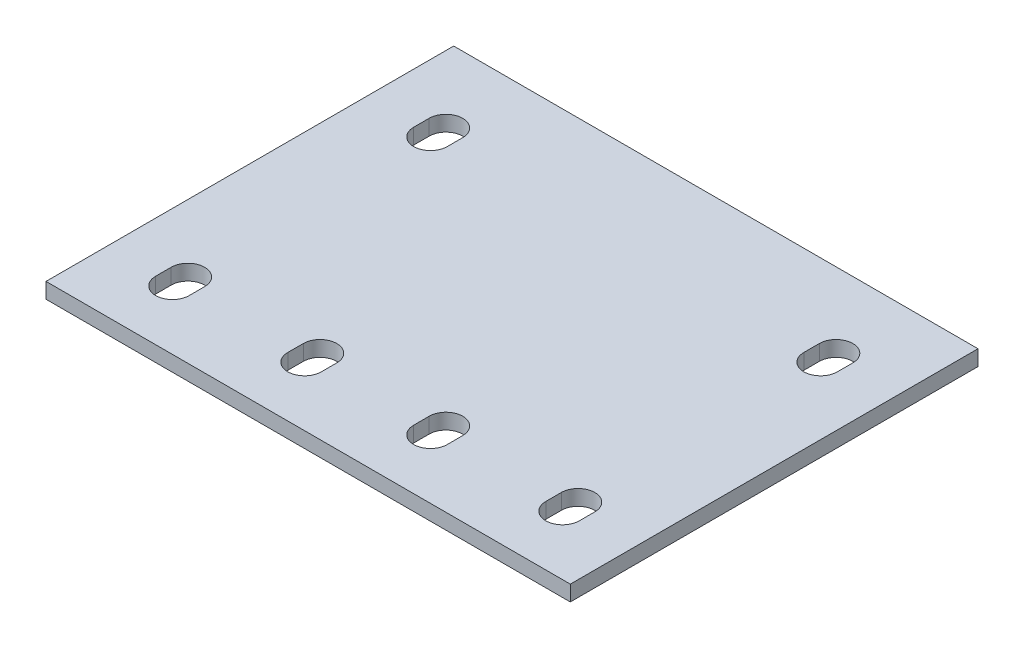
ISO-10303-21;
HEADER;
FILE_DESCRIPTION(('STEP AP214'),'2;1');
FILE_NAME('part.step','',(''),(''),'','','');
FILE_SCHEMA(('AUTOMOTIVE_DESIGN { 1 0 10303 214 1 1 1 1 }'));
ENDSEC;
DATA;
#1=APPLICATION_CONTEXT('core data for automotive mechanical design processes');
#2=APPLICATION_PROTOCOL_DEFINITION('international standard','automotive_design',2000,#1);
#3=PRODUCT_CONTEXT('',#1,'mechanical');
#4=PRODUCT('Part','Part','',(#3));
#5=PRODUCT_RELATED_PRODUCT_CATEGORY('part','',(#4));
#6=PRODUCT_DEFINITION_FORMATION('','',#4);
#7=PRODUCT_DEFINITION_CONTEXT('part definition',#1,'design');
#8=PRODUCT_DEFINITION('design','',#6,#7);
#9=PRODUCT_DEFINITION_SHAPE('','',#8);
#10=(LENGTH_UNIT() NAMED_UNIT(*) SI_UNIT(.MILLI.,.METRE.));
#11=(NAMED_UNIT(*) PLANE_ANGLE_UNIT() SI_UNIT($,.RADIAN.));
#12=(NAMED_UNIT(*) SI_UNIT($,.STERADIAN.) SOLID_ANGLE_UNIT());
#13=UNCERTAINTY_MEASURE_WITH_UNIT(LENGTH_MEASURE(1.E-05),#10,'distance_accuracy_value','');
#14=(GEOMETRIC_REPRESENTATION_CONTEXT(3) GLOBAL_UNCERTAINTY_ASSIGNED_CONTEXT((#13)) GLOBAL_UNIT_ASSIGNED_CONTEXT((#10,
#11,#12)) REPRESENTATION_CONTEXT('',''));
#15=CARTESIAN_POINT('',(0.,0.,0.));
#16=DIRECTION('',(0.,0.,1.));
#17=DIRECTION('',(1.,0.,0.));
#18=AXIS2_PLACEMENT_3D('',#15,#16,#17);
#19=CARTESIAN_POINT('',(0.,3.,0.));
#20=DIRECTION('',(0.,-0.999999999999999,0.));
#21=DIRECTION('',(0.,0.,-0.999999999999999));
#22=AXIS2_PLACEMENT_3D('',#19,#20,#21);
#23=PLANE('',#22);
#24=CARTESIAN_POINT('',(82.2274092895389,3.00000000000003,-51.5));
#25=DIRECTION('',(0.,0.999999999999999,0.));
#26=DIRECTION('',(0.,0.,0.999999999999999));
#27=AXIS2_PLACEMENT_3D('',#24,#25,#26);
#28=CIRCLE('',#27,3.25);
#29=CARTESIAN_POINT('',(85.4774092895388,3.00000000000003,-51.5000000000001));
#30=VERTEX_POINT('',#29);
#31=CARTESIAN_POINT('',(78.9774092895388,3.00000000000003,-51.5));
#32=VERTEX_POINT('',#31);
#33=EDGE_CURVE('E281',#30,#32,#28,.T.);
#34=ORIENTED_EDGE('',*,*,#33,.F.);
#35=DIRECTION('',(0.,0.,-0.999999999999999));
#36=VECTOR('',#35,1.);
#37=CARTESIAN_POINT('',(85.4774092895388,3.00000000000003,-51.5000000000001));
#38=LINE('',#37,#36);
#39=CARTESIAN_POINT('',(85.4774092895388,3.00000000000003,-48.5000000000001));
#40=VERTEX_POINT('',#39);
#41=EDGE_CURVE('E292',#40,#30,#38,.T.);
#42=ORIENTED_EDGE('',*,*,#41,.F.);
#43=CARTESIAN_POINT('',(82.2274092895389,3.00000000000003,-48.5000000000001));
#44=DIRECTION('',(0.,0.999999999999999,0.));
#45=DIRECTION('',(0.,0.,0.999999999999999));
#46=AXIS2_PLACEMENT_3D('',#43,#44,#45);
#47=CIRCLE('',#46,3.25);
#48=CARTESIAN_POINT('',(78.9774092895389,3.00000000000003,-48.5000000000001));
#49=VERTEX_POINT('',#48);
#50=EDGE_CURVE('E288',#49,#40,#47,.T.);
#51=ORIENTED_EDGE('',*,*,#50,.F.);
#52=DIRECTION('',(0.,0.,0.999999999999999));
#53=VECTOR('',#52,1.);
#54=CARTESIAN_POINT('',(78.9774092895388,3.00000000000003,-51.5));
#55=LINE('',#54,#53);
#56=EDGE_CURVE('E284',#32,#49,#55,.T.);
#57=ORIENTED_EDGE('',*,*,#56,.F.);
#58=EDGE_LOOP('',(#34,#42,#51,#57));
#59=FACE_BOUND('',#58,.T.);
#60=CARTESIAN_POINT('',(82.2274092895388,3.,-1.50000000000009));
#61=DIRECTION('',(0.,0.999999999999999,0.));
#62=DIRECTION('',(0.,0.,-0.999999999999999));
#63=AXIS2_PLACEMENT_3D('',#60,#61,#62);
#64=CIRCLE('',#63,3.25);
#65=CARTESIAN_POINT('',(85.4774092895389,3.,-1.50000000000019));
#66=VERTEX_POINT('',#65);
#67=CARTESIAN_POINT('',(78.9774092895388,2.99999999999995,-1.50000000000019));
#68=VERTEX_POINT('',#67);
#69=EDGE_CURVE('E367',#66,#68,#64,.T.);
#70=ORIENTED_EDGE('',*,*,#69,.F.);
#71=DIRECTION('',(0.,0.,-0.999999999999999));
#72=VECTOR('',#71,1.);
#73=CARTESIAN_POINT('',(85.4774092895389,3.,-1.50000000000019));
#74=LINE('',#73,#72);
#75=CARTESIAN_POINT('',(85.477409289539,2.99999999999998,1.4999999999999));
#76=VERTEX_POINT('',#75);
#77=EDGE_CURVE('E378',#76,#66,#74,.T.);
#78=ORIENTED_EDGE('',*,*,#77,.F.);
#79=CARTESIAN_POINT('',(82.2274092895388,3.00000000000006,1.4999999999999));
#80=DIRECTION('',(0.,0.999999999999999,0.));
#81=DIRECTION('',(0.,0.,-0.999999999999999));
#82=AXIS2_PLACEMENT_3D('',#79,#80,#81);
#83=CIRCLE('',#82,3.25);
#84=CARTESIAN_POINT('',(78.9774092895389,3.,1.49999999999991));
#85=VERTEX_POINT('',#84);
#86=EDGE_CURVE('E374',#85,#76,#83,.T.);
#87=ORIENTED_EDGE('',*,*,#86,.F.);
#88=DIRECTION('',(0.,0.,0.999999999999999));
#89=VECTOR('',#88,1.);
#90=CARTESIAN_POINT('',(78.9774092895388,2.99999999999995,-1.50000000000019));
#91=LINE('',#90,#89);
#92=EDGE_CURVE('E370',#68,#85,#91,.T.);
#93=ORIENTED_EDGE('',*,*,#92,.F.);
#94=EDGE_LOOP('',(#70,#78,#87,#93));
#95=FACE_BOUND('',#94,.T.);
#96=CARTESIAN_POINT('',(6.62740928953888,2.99999999999998,-1.50000000000005));
#97=DIRECTION('',(0.,0.999999999999999,0.));
#98=DIRECTION('',(0.,0.,0.999999999999999));
#99=AXIS2_PLACEMENT_3D('',#96,#97,#98);
#100=CIRCLE('',#99,3.24999999999999);
#101=CARTESIAN_POINT('',(9.87740928953888,3.,-1.49999999999999));
#102=VERTEX_POINT('',#101);
#103=CARTESIAN_POINT('',(3.37740928953889,3.,-1.50000000000004));
#104=VERTEX_POINT('',#103);
#105=EDGE_CURVE('E453',#102,#104,#100,.T.);
#106=ORIENTED_EDGE('',*,*,#105,.F.);
#107=DIRECTION('',(0.,0.,-0.999999999999999));
#108=VECTOR('',#107,1.);
#109=CARTESIAN_POINT('',(9.87740928953888,3.,-1.49999999999999));
#110=LINE('',#109,#108);
#111=CARTESIAN_POINT('',(9.87740928953891,3.,1.49999999999994));
#112=VERTEX_POINT('',#111);
#113=EDGE_CURVE('E464',#112,#102,#110,.T.);
#114=ORIENTED_EDGE('',*,*,#113,.F.);
#115=CARTESIAN_POINT('',(6.62740928953881,3.,1.49999999999994));
#116=DIRECTION('',(0.,0.999999999999999,0.));
#117=DIRECTION('',(0.,0.,0.999999999999999));
#118=AXIS2_PLACEMENT_3D('',#115,#116,#117);
#119=CIRCLE('',#118,3.24999999999999);
#120=CARTESIAN_POINT('',(3.37740928953884,3.,1.49999999999992));
#121=VERTEX_POINT('',#120);
#122=EDGE_CURVE('E460',#121,#112,#119,.T.);
#123=ORIENTED_EDGE('',*,*,#122,.F.);
#124=DIRECTION('',(0.,0.,0.999999999999999));
#125=VECTOR('',#124,1.);
#126=CARTESIAN_POINT('',(3.37740928953889,3.,-1.50000000000004));
#127=LINE('',#126,#125);
#128=EDGE_CURVE('E456',#104,#121,#127,.T.);
#129=ORIENTED_EDGE('',*,*,#128,.F.);
#130=EDGE_LOOP('',(#106,#114,#123,#129));
#131=FACE_BOUND('',#130,.T.);
#132=DIRECTION('',(0.,0.,0.999999999999999));
#133=VECTOR('',#132,1.);
#134=CARTESIAN_POINT('',(-6.3725907104611,3.,12.9999999999999));
#135=LINE('',#134,#133);
#136=CARTESIAN_POINT('',(-6.37259071046108,3.00000000000003,-66.));
#137=VERTEX_POINT('',#136);
#138=CARTESIAN_POINT('',(-6.3725907104611,3.,12.9999999999999));
#139=VERTEX_POINT('',#138);
#140=EDGE_CURVE('E496',#137,#139,#135,.T.);
#141=ORIENTED_EDGE('',*,*,#140,.T.);
#142=DIRECTION('',(0.999999999999999,0.,0.));
#143=VECTOR('',#142,1.);
#144=CARTESIAN_POINT('',(95.2274092895388,3.,12.9999999999999));
#145=LINE('',#144,#143);
#146=CARTESIAN_POINT('',(95.2274092895388,3.,12.9999999999999));
#147=VERTEX_POINT('',#146);
#148=EDGE_CURVE('E500',#139,#147,#145,.T.);
#149=ORIENTED_EDGE('',*,*,#148,.T.);
#150=DIRECTION('',(0.,0.,-0.999999999999999));
#151=VECTOR('',#150,1.);
#152=CARTESIAN_POINT('',(95.2274092895389,3.00000000000006,-66.));
#153=LINE('',#152,#151);
#154=CARTESIAN_POINT('',(95.2274092895389,3.00000000000006,-66.));
#155=VERTEX_POINT('',#154);
#156=EDGE_CURVE('E504',#147,#155,#153,.T.);
#157=ORIENTED_EDGE('',*,*,#156,.T.);
#158=DIRECTION('',(-0.999999999999999,0.,0.));
#159=VECTOR('',#158,1.);
#160=CARTESIAN_POINT('',(-6.37259071046108,3.00000000000003,-66.));
#161=LINE('',#160,#159);
#162=EDGE_CURVE('E507',#155,#137,#161,.T.);
#163=ORIENTED_EDGE('',*,*,#162,.T.);
#164=EDGE_LOOP('',(#141,#149,#157,#163));
#165=FACE_BOUND('',#164,.T.);
#166=CARTESIAN_POINT('',(6.62740928953888,2.99999999999998,-51.5));
#167=DIRECTION('',(0.,0.999999999999999,0.));
#168=DIRECTION('',(0.,0.,0.999999999999999));
#169=AXIS2_PLACEMENT_3D('',#166,#167,#168);
#170=CIRCLE('',#169,3.25);
#171=CARTESIAN_POINT('',(9.87740928953897,3.,-51.5));
#172=VERTEX_POINT('',#171);
#173=CARTESIAN_POINT('',(3.3774092895389,3.,-51.5));
#174=VERTEX_POINT('',#173);
#175=EDGE_CURVE('E410',#172,#174,#170,.T.);
#176=ORIENTED_EDGE('',*,*,#175,.F.);
#177=DIRECTION('',(0.,0.,-0.999999999999999));
#178=VECTOR('',#177,1.);
#179=CARTESIAN_POINT('',(9.87740928953897,3.,-51.5));
#180=LINE('',#179,#178);
#181=CARTESIAN_POINT('',(9.87740928953891,2.99999999999998,-48.5));
#182=VERTEX_POINT('',#181);
#183=EDGE_CURVE('E421',#182,#172,#180,.T.);
#184=ORIENTED_EDGE('',*,*,#183,.F.);
#185=CARTESIAN_POINT('',(6.62740928953889,3.00000000000006,-48.5));
#186=DIRECTION('',(0.,0.999999999999999,0.));
#187=DIRECTION('',(0.,0.,0.999999999999999));
#188=AXIS2_PLACEMENT_3D('',#185,#186,#187);
#189=CIRCLE('',#188,3.25);
#190=CARTESIAN_POINT('',(3.37740928953893,2.99999999999998,-48.5));
#191=VERTEX_POINT('',#190);
#192=EDGE_CURVE('E417',#191,#182,#189,.T.);
#193=ORIENTED_EDGE('',*,*,#192,.F.);
#194=DIRECTION('',(0.,0.,0.999999999999999));
#195=VECTOR('',#194,1.);
#196=CARTESIAN_POINT('',(3.3774092895389,3.,-51.5));
#197=LINE('',#196,#195);
#198=EDGE_CURVE('E413',#174,#191,#197,.T.);
#199=ORIENTED_EDGE('',*,*,#198,.F.);
#200=EDGE_LOOP('',(#176,#184,#193,#199));
#201=FACE_BOUND('',#200,.T.);
#202=CARTESIAN_POINT('',(56.6274092895388,2.99999999999998,-1.50000000000013));
#203=DIRECTION('',(0.,0.999999999999999,0.));
#204=DIRECTION('',(0.,0.,0.999999999999999));
#205=AXIS2_PLACEMENT_3D('',#202,#203,#204);
#206=CIRCLE('',#205,3.25000000000001);
#207=CARTESIAN_POINT('',(59.8774092895389,3.00000000000003,-1.5000000000001));
#208=VERTEX_POINT('',#207);
#209=CARTESIAN_POINT('',(53.3774092895388,3.,-1.50000000000006));
#210=VERTEX_POINT('',#209);
#211=EDGE_CURVE('E324',#208,#210,#206,.T.);
#212=ORIENTED_EDGE('',*,*,#211,.F.);
#213=DIRECTION('',(0.,0.,-0.999999999999999));
#214=VECTOR('',#213,1.);
#215=CARTESIAN_POINT('',(59.8774092895389,3.00000000000003,-1.5000000000001));
#216=LINE('',#215,#214);
#217=CARTESIAN_POINT('',(59.8774092895388,2.99999999999995,1.49999999999983));
#218=VERTEX_POINT('',#217);
#219=EDGE_CURVE('E335',#218,#208,#216,.T.);
#220=ORIENTED_EDGE('',*,*,#219,.F.);
#221=CARTESIAN_POINT('',(56.6274092895389,3.00000000000003,1.49999999999988));
#222=DIRECTION('',(0.,0.999999999999999,0.));
#223=DIRECTION('',(0.,0.,0.999999999999999));
#224=AXIS2_PLACEMENT_3D('',#221,#222,#223);
#225=CIRCLE('',#224,3.25000000000001);
#226=CARTESIAN_POINT('',(53.3774092895388,3.00000000000003,1.49999999999994));
#227=VERTEX_POINT('',#226);
#228=EDGE_CURVE('E331',#227,#218,#225,.T.);
#229=ORIENTED_EDGE('',*,*,#228,.F.);
#230=DIRECTION('',(0.,0.,0.999999999999999));
#231=VECTOR('',#230,1.);
#232=CARTESIAN_POINT('',(53.3774092895388,3.,-1.50000000000006));
#233=LINE('',#232,#231);
#234=EDGE_CURVE('E327',#210,#227,#233,.T.);
#235=ORIENTED_EDGE('',*,*,#234,.F.);
#236=EDGE_LOOP('',(#212,#220,#229,#235));
#237=FACE_BOUND('',#236,.T.);
#238=CARTESIAN_POINT('',(32.2274092895389,3.,-1.50000000000006));
#239=DIRECTION('',(0.,0.999999999999999,0.));
#240=DIRECTION('',(0.,0.,-0.999999999999999));
#241=AXIS2_PLACEMENT_3D('',#238,#239,#240);
#242=CIRCLE('',#241,3.25);
#243=CARTESIAN_POINT('',(35.4774092895388,2.99999999999998,-1.50000000000006));
#244=VERTEX_POINT('',#243);
#245=CARTESIAN_POINT('',(28.9774092895388,3.,-1.5000000000001));
#246=VERTEX_POINT('',#245);
#247=EDGE_CURVE('E232',#244,#246,#242,.T.);
#248=ORIENTED_EDGE('',*,*,#247,.F.);
#249=DIRECTION('',(0.,0.,-0.999999999999999));
#250=VECTOR('',#249,1.);
#251=CARTESIAN_POINT('',(35.4774092895388,2.99999999999998,-1.50000000000006));
#252=LINE('',#251,#250);
#253=CARTESIAN_POINT('',(35.4774092895389,3.,1.49999999999995));
#254=VERTEX_POINT('',#253);
#255=EDGE_CURVE('E259',#254,#244,#252,.T.);
#256=ORIENTED_EDGE('',*,*,#255,.F.);
#257=CARTESIAN_POINT('',(32.2274092895388,3.00000000000003,1.4999999999999));
#258=DIRECTION('',(0.,0.999999999999999,0.));
#259=DIRECTION('',(0.,0.,-0.999999999999999));
#260=AXIS2_PLACEMENT_3D('',#257,#258,#259);
#261=CIRCLE('',#260,3.25);
#262=CARTESIAN_POINT('',(28.9774092895388,2.99999999999995,1.49999999999997));
#263=VERTEX_POINT('',#262);
#264=EDGE_CURVE('E254',#263,#254,#261,.T.);
#265=ORIENTED_EDGE('',*,*,#264,.F.);
#266=DIRECTION('',(0.,0.,0.999999999999999));
#267=VECTOR('',#266,1.);
#268=CARTESIAN_POINT('',(28.9774092895388,3.,-1.5000000000001));
#269=LINE('',#268,#267);
#270=EDGE_CURVE('E241',#246,#263,#269,.T.);
#271=ORIENTED_EDGE('',*,*,#270,.F.);
#272=EDGE_LOOP('',(#248,#256,#265,#271));
#273=FACE_BOUND('',#272,.T.);
#274=ADVANCED_FACE('F46',(#59,#95,#131,#165,#201,#237,#273),#23,.F.);
#275=CARTESIAN_POINT('',(0.,0.,0.));
#276=DIRECTION('',(0.,-0.999999999999999,0.));
#277=DIRECTION('',(0.,0.,-0.999999999999999));
#278=AXIS2_PLACEMENT_3D('',#275,#276,#277);
#279=PLANE('',#278);
#280=DIRECTION('',(0.,0.,0.999999999999999));
#281=VECTOR('',#280,1.);
#282=CARTESIAN_POINT('',(-6.37259071046116,0.,12.9999999999999));
#283=LINE('',#282,#281);
#284=CARTESIAN_POINT('',(-6.37259071046108,0.,-65.9999999999999));
#285=VERTEX_POINT('',#284);
#286=CARTESIAN_POINT('',(-6.37259071046116,0.,12.9999999999999));
#287=VERTEX_POINT('',#286);
#288=EDGE_CURVE('E495',#285,#287,#283,.T.);
#289=ORIENTED_EDGE('',*,*,#288,.F.);
#290=DIRECTION('',(-0.999999999999999,0.,0.));
#291=VECTOR('',#290,1.);
#292=CARTESIAN_POINT('',(-6.37259071046108,0.,-65.9999999999999));
#293=LINE('',#292,#291);
#294=CARTESIAN_POINT('',(95.2274092895389,0.,-66.));
#295=VERTEX_POINT('',#294);
#296=EDGE_CURVE('E501',#295,#285,#293,.T.);
#297=ORIENTED_EDGE('',*,*,#296,.F.);
#298=DIRECTION('',(0.,0.,-0.999999999999999));
#299=VECTOR('',#298,1.);
#300=CARTESIAN_POINT('',(95.2274092895389,0.,-66.));
#301=LINE('',#300,#299);
#302=CARTESIAN_POINT('',(95.2274092895388,0.,12.9999999999998));
#303=VERTEX_POINT('',#302);
#304=EDGE_CURVE('E517',#303,#295,#301,.T.);
#305=ORIENTED_EDGE('',*,*,#304,.F.);
#306=DIRECTION('',(0.999999999999999,0.,0.));
#307=VECTOR('',#306,1.);
#308=CARTESIAN_POINT('',(95.2274092895388,0.,12.9999999999998));
#309=LINE('',#308,#307);
#310=EDGE_CURVE('E514',#287,#303,#309,.T.);
#311=ORIENTED_EDGE('',*,*,#310,.F.);
#312=EDGE_LOOP('',(#289,#297,#305,#311));
#313=FACE_BOUND('',#312,.T.);
#314=DIRECTION('',(0.,0.,-0.999999999999999));
#315=VECTOR('',#314,1.);
#316=CARTESIAN_POINT('',(9.87740928953883,0.,-1.50000000000001));
#317=LINE('',#316,#315);
#318=CARTESIAN_POINT('',(9.8774092895389,0.,1.49999999999997));
#319=VERTEX_POINT('',#318);
#320=CARTESIAN_POINT('',(9.87740928953883,0.,-1.50000000000001));
#321=VERTEX_POINT('',#320);
#322=EDGE_CURVE('E457',#319,#321,#317,.T.);
#323=ORIENTED_EDGE('',*,*,#322,.T.);
#324=CARTESIAN_POINT('',(6.62740928953887,0.,-1.50000000000012));
#325=DIRECTION('',(0.,0.999999999999999,0.));
#326=DIRECTION('',(0.,0.,0.999999999999999));
#327=AXIS2_PLACEMENT_3D('',#324,#325,#326);
#328=CIRCLE('',#327,3.24999999999999);
#329=CARTESIAN_POINT('',(3.37740928953888,0.,-1.50000000000003));
#330=VERTEX_POINT('',#329);
#331=EDGE_CURVE('E452',#321,#330,#328,.T.);
#332=ORIENTED_EDGE('',*,*,#331,.T.);
#333=DIRECTION('',(0.,0.,0.999999999999999));
#334=VECTOR('',#333,1.);
#335=CARTESIAN_POINT('',(3.37740928953888,0.,-1.50000000000003));
#336=LINE('',#335,#334);
#337=CARTESIAN_POINT('',(3.37740928953889,0.,1.49999999999995));
#338=VERTEX_POINT('',#337);
#339=EDGE_CURVE('E471',#330,#338,#336,.T.);
#340=ORIENTED_EDGE('',*,*,#339,.T.);
#341=CARTESIAN_POINT('',(6.62740928953888,0.,1.49999999999997));
#342=DIRECTION('',(0.,0.999999999999999,0.));
#343=DIRECTION('',(0.,0.,0.999999999999999));
#344=AXIS2_PLACEMENT_3D('',#341,#342,#343);
#345=CIRCLE('',#344,3.24999999999999);
#346=EDGE_CURVE('E475',#338,#319,#345,.T.);
#347=ORIENTED_EDGE('',*,*,#346,.T.);
#348=EDGE_LOOP('',(#323,#332,#340,#347));
#349=FACE_BOUND('',#348,.T.);
#350=DIRECTION('',(0.,0.,-0.999999999999999));
#351=VECTOR('',#350,1.);
#352=CARTESIAN_POINT('',(9.8774092895389,0.,-51.4999999999999));
#353=LINE('',#352,#351);
#354=CARTESIAN_POINT('',(9.8774092895389,0.,-48.4999999999999));
#355=VERTEX_POINT('',#354);
#356=CARTESIAN_POINT('',(9.8774092895389,0.,-51.4999999999999));
#357=VERTEX_POINT('',#356);
#358=EDGE_CURVE('E414',#355,#357,#353,.T.);
#359=ORIENTED_EDGE('',*,*,#358,.T.);
#360=CARTESIAN_POINT('',(6.62740928953888,0.,-51.5));
#361=DIRECTION('',(0.,0.999999999999999,0.));
#362=DIRECTION('',(0.,0.,0.999999999999999));
#363=AXIS2_PLACEMENT_3D('',#360,#361,#362);
#364=CIRCLE('',#363,3.25);
#365=CARTESIAN_POINT('',(3.3774092895389,0.,-51.5));
#366=VERTEX_POINT('',#365);
#367=EDGE_CURVE('E409',#357,#366,#364,.T.);
#368=ORIENTED_EDGE('',*,*,#367,.T.);
#369=DIRECTION('',(0.,0.,0.999999999999999));
#370=VECTOR('',#369,1.);
#371=CARTESIAN_POINT('',(3.3774092895389,0.,-51.5));
#372=LINE('',#371,#370);
#373=CARTESIAN_POINT('',(3.37740928953895,0.,-48.5));
#374=VERTEX_POINT('',#373);
#375=EDGE_CURVE('E428',#366,#374,#372,.T.);
#376=ORIENTED_EDGE('',*,*,#375,.T.);
#377=CARTESIAN_POINT('',(6.62740928953894,0.,-48.5));
#378=DIRECTION('',(0.,0.999999999999999,0.));
#379=DIRECTION('',(0.,0.,0.999999999999999));
#380=AXIS2_PLACEMENT_3D('',#377,#378,#379);
#381=CIRCLE('',#380,3.25);
#382=EDGE_CURVE('E432',#374,#355,#381,.T.);
#383=ORIENTED_EDGE('',*,*,#382,.T.);
#384=EDGE_LOOP('',(#359,#368,#376,#383));
#385=FACE_BOUND('',#384,.T.);
#386=DIRECTION('',(0.,0.,-0.999999999999999));
#387=VECTOR('',#386,1.);
#388=CARTESIAN_POINT('',(85.4774092895388,0.,-1.50000000000009));
#389=LINE('',#388,#387);
#390=CARTESIAN_POINT('',(85.4774092895389,0.,1.4999999999999));
#391=VERTEX_POINT('',#390);
#392=CARTESIAN_POINT('',(85.4774092895388,0.,-1.50000000000009));
#393=VERTEX_POINT('',#392);
#394=EDGE_CURVE('E371',#391,#393,#389,.T.);
#395=ORIENTED_EDGE('',*,*,#394,.T.);
#396=CARTESIAN_POINT('',(82.2274092895388,0.,-1.50000000000009));
#397=DIRECTION('',(0.,0.999999999999999,0.));
#398=DIRECTION('',(0.,0.,-0.999999999999999));
#399=AXIS2_PLACEMENT_3D('',#396,#397,#398);
#400=CIRCLE('',#399,3.25);
#401=CARTESIAN_POINT('',(78.9774092895389,0.,-1.50000000000015));
#402=VERTEX_POINT('',#401);
#403=EDGE_CURVE('E366',#393,#402,#400,.T.);
#404=ORIENTED_EDGE('',*,*,#403,.T.);
#405=DIRECTION('',(0.,0.,0.999999999999999));
#406=VECTOR('',#405,1.);
#407=CARTESIAN_POINT('',(78.9774092895389,0.,-1.50000000000015));
#408=LINE('',#407,#406);
#409=CARTESIAN_POINT('',(78.9774092895388,0.,1.49999999999992));
#410=VERTEX_POINT('',#409);
#411=EDGE_CURVE('E385',#402,#410,#408,.T.);
#412=ORIENTED_EDGE('',*,*,#411,.T.);
#413=CARTESIAN_POINT('',(82.2274092895388,0.,1.4999999999999));
#414=DIRECTION('',(0.,0.999999999999999,0.));
#415=DIRECTION('',(0.,0.,-0.999999999999999));
#416=AXIS2_PLACEMENT_3D('',#413,#414,#415);
#417=CIRCLE('',#416,3.25);
#418=EDGE_CURVE('E389',#410,#391,#417,.T.);
#419=ORIENTED_EDGE('',*,*,#418,.T.);
#420=EDGE_LOOP('',(#395,#404,#412,#419));
#421=FACE_BOUND('',#420,.T.);
#422=DIRECTION('',(0.,0.,-0.999999999999999));
#423=VECTOR('',#422,1.);
#424=CARTESIAN_POINT('',(59.8774092895388,0.,-1.50000000000017));
#425=LINE('',#424,#423);
#426=CARTESIAN_POINT('',(59.8774092895388,0.,1.49999999999994));
#427=VERTEX_POINT('',#426);
#428=CARTESIAN_POINT('',(59.8774092895388,0.,-1.50000000000017));
#429=VERTEX_POINT('',#428);
#430=EDGE_CURVE('E328',#427,#429,#425,.T.);
#431=ORIENTED_EDGE('',*,*,#430,.T.);
#432=CARTESIAN_POINT('',(56.6274092895388,0.,-1.50000000000013));
#433=DIRECTION('',(0.,0.999999999999999,0.));
#434=DIRECTION('',(0.,0.,0.999999999999999));
#435=AXIS2_PLACEMENT_3D('',#432,#433,#434);
#436=CIRCLE('',#435,3.25000000000001);
#437=CARTESIAN_POINT('',(53.3774092895388,0.,-1.50000000000006));
#438=VERTEX_POINT('',#437);
#439=EDGE_CURVE('E323',#429,#438,#436,.T.);
#440=ORIENTED_EDGE('',*,*,#439,.T.);
#441=DIRECTION('',(0.,0.,0.999999999999999));
#442=VECTOR('',#441,1.);
#443=CARTESIAN_POINT('',(53.3774092895388,0.,-1.50000000000006));
#444=LINE('',#443,#442);
#445=CARTESIAN_POINT('',(53.3774092895388,0.,1.49999999999994));
#446=VERTEX_POINT('',#445);
#447=EDGE_CURVE('E342',#438,#446,#444,.T.);
#448=ORIENTED_EDGE('',*,*,#447,.T.);
#449=CARTESIAN_POINT('',(56.6274092895388,0.,1.49999999999981));
#450=DIRECTION('',(0.,0.999999999999999,0.));
#451=DIRECTION('',(0.,0.,0.999999999999999));
#452=AXIS2_PLACEMENT_3D('',#449,#450,#451);
#453=CIRCLE('',#452,3.25000000000001);
#454=EDGE_CURVE('E346',#446,#427,#453,.T.);
#455=ORIENTED_EDGE('',*,*,#454,.T.);
#456=EDGE_LOOP('',(#431,#440,#448,#455));
#457=FACE_BOUND('',#456,.T.);
#458=DIRECTION('',(0.,0.,-0.999999999999999));
#459=VECTOR('',#458,1.);
#460=CARTESIAN_POINT('',(85.4774092895389,0.,-51.5));
#461=LINE('',#460,#459);
#462=CARTESIAN_POINT('',(85.4774092895389,0.,-48.5000000000001));
#463=VERTEX_POINT('',#462);
#464=CARTESIAN_POINT('',(85.4774092895389,0.,-51.5));
#465=VERTEX_POINT('',#464);
#466=EDGE_CURVE('E285',#463,#465,#461,.T.);
#467=ORIENTED_EDGE('',*,*,#466,.T.);
#468=CARTESIAN_POINT('',(82.2274092895388,0.,-51.5000000000001));
#469=DIRECTION('',(0.,0.999999999999999,0.));
#470=DIRECTION('',(0.,0.,0.999999999999999));
#471=AXIS2_PLACEMENT_3D('',#468,#469,#470);
#472=CIRCLE('',#471,3.25);
#473=CARTESIAN_POINT('',(78.9774092895388,0.,-51.5));
#474=VERTEX_POINT('',#473);
#475=EDGE_CURVE('E250',#465,#474,#472,.T.);
#476=ORIENTED_EDGE('',*,*,#475,.T.);
#477=DIRECTION('',(0.,0.,0.999999999999999));
#478=VECTOR('',#477,1.);
#479=CARTESIAN_POINT('',(78.9774092895388,0.,-51.5));
#480=LINE('',#479,#478);
#481=CARTESIAN_POINT('',(78.9774092895389,0.,-48.5));
#482=VERTEX_POINT('',#481);
#483=EDGE_CURVE('E299',#474,#482,#480,.T.);
#484=ORIENTED_EDGE('',*,*,#483,.T.);
#485=CARTESIAN_POINT('',(82.2274092895388,0.,-48.5000000000001));
#486=DIRECTION('',(0.,0.999999999999999,0.));
#487=DIRECTION('',(0.,0.,0.999999999999999));
#488=AXIS2_PLACEMENT_3D('',#485,#486,#487);
#489=CIRCLE('',#488,3.25);
#490=EDGE_CURVE('E303',#482,#463,#489,.T.);
#491=ORIENTED_EDGE('',*,*,#490,.T.);
#492=EDGE_LOOP('',(#467,#476,#484,#491));
#493=FACE_BOUND('',#492,.T.);
#494=DIRECTION('',(0.,0.,-0.999999999999999));
#495=VECTOR('',#494,1.);
#496=CARTESIAN_POINT('',(35.4774092895389,0.,-1.50000000000011));
#497=LINE('',#496,#495);
#498=CARTESIAN_POINT('',(35.4774092895389,0.,1.49999999999995));
#499=VERTEX_POINT('',#498);
#500=CARTESIAN_POINT('',(35.4774092895389,0.,-1.50000000000011));
#501=VERTEX_POINT('',#500);
#502=EDGE_CURVE('E242',#499,#501,#497,.T.);
#503=ORIENTED_EDGE('',*,*,#502,.T.);
#504=CARTESIAN_POINT('',(32.2274092895389,0.,-1.50000000000005));
#505=DIRECTION('',(0.,0.999999999999999,0.));
#506=DIRECTION('',(0.,0.,-0.999999999999999));
#507=AXIS2_PLACEMENT_3D('',#504,#505,#506);
#508=CIRCLE('',#507,3.25);
#509=CARTESIAN_POINT('',(28.9774092895389,0.,-1.50000000000004));
#510=VERTEX_POINT('',#509);
#511=EDGE_CURVE('E70',#501,#510,#508,.T.);
#512=ORIENTED_EDGE('',*,*,#511,.T.);
#513=DIRECTION('',(0.,0.,0.999999999999999));
#514=VECTOR('',#513,1.);
#515=CARTESIAN_POINT('',(28.9774092895389,0.,-1.50000000000004));
#516=LINE('',#515,#514);
#517=CARTESIAN_POINT('',(28.9774092895389,0.,1.49999999999995));
#518=VERTEX_POINT('',#517);
#519=EDGE_CURVE('E248',#510,#518,#516,.T.);
#520=ORIENTED_EDGE('',*,*,#519,.T.);
#521=CARTESIAN_POINT('',(32.2274092895388,0.,1.49999999999988));
#522=DIRECTION('',(0.,0.999999999999999,0.));
#523=DIRECTION('',(0.,0.,-0.999999999999999));
#524=AXIS2_PLACEMENT_3D('',#521,#522,#523);
#525=CIRCLE('',#524,3.25);
#526=EDGE_CURVE('E268',#518,#499,#525,.T.);
#527=ORIENTED_EDGE('',*,*,#526,.T.);
#528=EDGE_LOOP('',(#503,#512,#520,#527));
#529=FACE_BOUND('',#528,.T.);
#530=ADVANCED_FACE('F541',(#313,#349,#385,#421,#457,#493,#529),#279,.T.);
#531=CARTESIAN_POINT('',(-6.3725907104611,3.,12.9999999999999));
#532=DIRECTION('',(0.999999999999999,0.,0.));
#533=DIRECTION('',(0.,0.,-0.999999999999999));
#534=AXIS2_PLACEMENT_3D('',#531,#532,#533);
#535=PLANE('',#534);
#536=ORIENTED_EDGE('',*,*,#288,.T.);
#537=DIRECTION('',(0.,-0.999999999999999,0.));
#538=VECTOR('',#537,1.);
#539=CARTESIAN_POINT('',(-6.3725907104611,3.,12.9999999999999));
#540=LINE('',#539,#538);
#541=EDGE_CURVE('E13',#139,#287,#540,.T.);
#542=ORIENTED_EDGE('',*,*,#541,.F.);
#543=ORIENTED_EDGE('',*,*,#140,.F.);
#544=DIRECTION('',(0.,-0.999999999999999,0.));
#545=VECTOR('',#544,1.);
#546=CARTESIAN_POINT('',(-6.37259071046108,3.00000000000003,-66.));
#547=LINE('',#546,#545);
#548=EDGE_CURVE('E510',#137,#285,#547,.T.);
#549=ORIENTED_EDGE('',*,*,#548,.T.);
#550=EDGE_LOOP('',(#536,#542,#543,#549));
#551=FACE_BOUND('',#550,.T.);
#552=ADVANCED_FACE('F48',(#551),#535,.F.);
#553=CARTESIAN_POINT('',(95.2274092895388,3.,12.9999999999999));
#554=DIRECTION('',(0.,0.,-0.999999999999999));
#555=DIRECTION('',(-0.999999999999999,0.,0.));
#556=AXIS2_PLACEMENT_3D('',#553,#554,#555);
#557=PLANE('',#556);
#558=ORIENTED_EDGE('',*,*,#310,.T.);
#559=DIRECTION('',(0.,-0.999999999999999,0.));
#560=VECTOR('',#559,1.);
#561=CARTESIAN_POINT('',(95.2274092895388,3.,12.9999999999999));
#562=LINE('',#561,#560);
#563=EDGE_CURVE('E55',#147,#303,#562,.T.);
#564=ORIENTED_EDGE('',*,*,#563,.F.);
#565=ORIENTED_EDGE('',*,*,#148,.F.);
#566=ORIENTED_EDGE('',*,*,#541,.T.);
#567=EDGE_LOOP('',(#558,#564,#565,#566));
#568=FACE_BOUND('',#567,.T.);
#569=ADVANCED_FACE('F552',(#568),#557,.F.);
#570=CARTESIAN_POINT('',(95.2274092895389,3.00000000000006,-66.));
#571=DIRECTION('',(-0.999999999999999,0.,0.));
#572=DIRECTION('',(0.,0.,0.999999999999999));
#573=AXIS2_PLACEMENT_3D('',#570,#571,#572);
#574=PLANE('',#573);
#575=ORIENTED_EDGE('',*,*,#304,.T.);
#576=DIRECTION('',(0.,-0.999999999999999,0.));
#577=VECTOR('',#576,1.);
#578=CARTESIAN_POINT('',(95.2274092895389,3.00000000000006,-66.));
#579=LINE('',#578,#577);
#580=EDGE_CURVE('E525',#155,#295,#579,.T.);
#581=ORIENTED_EDGE('',*,*,#580,.F.);
#582=ORIENTED_EDGE('',*,*,#156,.F.);
#583=ORIENTED_EDGE('',*,*,#563,.T.);
#584=EDGE_LOOP('',(#575,#581,#582,#583));
#585=FACE_BOUND('',#584,.T.);
#586=ADVANCED_FACE('F535',(#585),#574,.F.);
#587=CARTESIAN_POINT('',(-6.37259071046108,3.00000000000003,-66.));
#588=DIRECTION('',(0.,0.,0.999999999999999));
#589=DIRECTION('',(0.999999999999999,0.,0.));
#590=AXIS2_PLACEMENT_3D('',#587,#588,#589);
#591=PLANE('',#590);
#592=ORIENTED_EDGE('',*,*,#296,.T.);
#593=ORIENTED_EDGE('',*,*,#548,.F.);
#594=ORIENTED_EDGE('',*,*,#162,.F.);
#595=ORIENTED_EDGE('',*,*,#580,.T.);
#596=EDGE_LOOP('',(#592,#593,#594,#595));
#597=FACE_BOUND('',#596,.T.);
#598=ADVANCED_FACE('F545',(#597),#591,.F.);
#599=CARTESIAN_POINT('',(6.62740928953888,2.99999999999998,-1.50000000000005));
#600=DIRECTION('',(0.,-0.999999999999999,0.));
#601=DIRECTION('',(0.,0.,-0.999999999999999));
#602=AXIS2_PLACEMENT_3D('',#599,#600,#601);
#603=CYLINDRICAL_SURFACE('',#602,3.24999999999999);
#604=ORIENTED_EDGE('',*,*,#331,.F.);
#605=DIRECTION('',(0.,-0.999999999999999,0.));
#606=VECTOR('',#605,1.);
#607=CARTESIAN_POINT('',(9.87740928953888,3.,-1.49999999999999));
#608=LINE('',#607,#606);
#609=EDGE_CURVE('E467',#102,#321,#608,.T.);
#610=ORIENTED_EDGE('',*,*,#609,.F.);
#611=ORIENTED_EDGE('',*,*,#105,.T.);
#612=DIRECTION('',(0.,-0.999999999999999,0.));
#613=VECTOR('',#612,1.);
#614=CARTESIAN_POINT('',(3.37740928953889,3.,-1.50000000000004));
#615=LINE('',#614,#613);
#616=EDGE_CURVE('E491',#104,#330,#615,.T.);
#617=ORIENTED_EDGE('',*,*,#616,.T.);
#618=EDGE_LOOP('',(#604,#610,#611,#617));
#619=FACE_BOUND('',#618,.T.);
#620=ADVANCED_FACE('F569',(#619),#603,.F.);
#621=CARTESIAN_POINT('',(3.37740928953889,3.,-1.50000000000004));
#622=DIRECTION('',(0.999999999999999,0.,0.));
#623=DIRECTION('',(0.,0.,-0.999999999999999));
#624=AXIS2_PLACEMENT_3D('',#621,#622,#623);
#625=PLANE('',#624);
#626=ORIENTED_EDGE('',*,*,#339,.F.);
#627=ORIENTED_EDGE('',*,*,#616,.F.);
#628=ORIENTED_EDGE('',*,*,#128,.T.);
#629=DIRECTION('',(0.,-0.999999999999999,0.));
#630=VECTOR('',#629,1.);
#631=CARTESIAN_POINT('',(3.37740928953884,3.,1.49999999999992));
#632=LINE('',#631,#630);
#633=EDGE_CURVE('E488',#121,#338,#632,.T.);
#634=ORIENTED_EDGE('',*,*,#633,.T.);
#635=EDGE_LOOP('',(#626,#627,#628,#634));
#636=FACE_BOUND('',#635,.T.);
#637=ADVANCED_FACE('F576',(#636),#625,.T.);
#638=CARTESIAN_POINT('',(6.62740928953881,3.,1.49999999999994));
#639=DIRECTION('',(0.,-0.999999999999999,0.));
#640=DIRECTION('',(0.,0.,-0.999999999999999));
#641=AXIS2_PLACEMENT_3D('',#638,#639,#640);
#642=CYLINDRICAL_SURFACE('',#641,3.24999999999999);
#643=ORIENTED_EDGE('',*,*,#346,.F.);
#644=ORIENTED_EDGE('',*,*,#633,.F.);
#645=ORIENTED_EDGE('',*,*,#122,.T.);
#646=DIRECTION('',(0.,-0.999999999999999,0.));
#647=VECTOR('',#646,1.);
#648=CARTESIAN_POINT('',(9.87740928953879,2.99999999999998,1.49999999999991));
#649=LINE('',#648,#647);
#650=EDGE_CURVE('E485',#112,#319,#649,.T.);
#651=ORIENTED_EDGE('',*,*,#650,.T.);
#652=EDGE_LOOP('',(#643,#644,#645,#651));
#653=FACE_BOUND('',#652,.T.);
#654=ADVANCED_FACE('F581',(#653),#642,.F.);
#655=CARTESIAN_POINT('',(9.87740928953888,3.,-1.49999999999999));
#656=DIRECTION('',(-0.999999999999999,0.,0.));
#657=DIRECTION('',(0.,0.,0.999999999999999));
#658=AXIS2_PLACEMENT_3D('',#655,#656,#657);
#659=PLANE('',#658);
#660=ORIENTED_EDGE('',*,*,#322,.F.);
#661=ORIENTED_EDGE('',*,*,#650,.F.);
#662=ORIENTED_EDGE('',*,*,#113,.T.);
#663=ORIENTED_EDGE('',*,*,#609,.T.);
#664=EDGE_LOOP('',(#660,#661,#662,#663));
#665=FACE_BOUND('',#664,.T.);
#666=ADVANCED_FACE('F588',(#665),#659,.T.);
#667=CARTESIAN_POINT('',(6.62740928953888,2.99999999999998,-51.5));
#668=DIRECTION('',(0.,-0.999999999999999,0.));
#669=DIRECTION('',(0.,0.,-0.999999999999999));
#670=AXIS2_PLACEMENT_3D('',#667,#668,#669);
#671=CYLINDRICAL_SURFACE('',#670,3.25);
#672=ORIENTED_EDGE('',*,*,#367,.F.);
#673=DIRECTION('',(0.,-0.999999999999999,0.));
#674=VECTOR('',#673,1.);
#675=CARTESIAN_POINT('',(9.87740928953897,3.,-51.5));
#676=LINE('',#675,#674);
#677=EDGE_CURVE('E424',#172,#357,#676,.T.);
#678=ORIENTED_EDGE('',*,*,#677,.F.);
#679=ORIENTED_EDGE('',*,*,#175,.T.);
#680=DIRECTION('',(0.,-0.999999999999999,0.));
#681=VECTOR('',#680,1.);
#682=CARTESIAN_POINT('',(3.3774092895389,3.,-51.5));
#683=LINE('',#682,#681);
#684=EDGE_CURVE('E448',#174,#366,#683,.T.);
#685=ORIENTED_EDGE('',*,*,#684,.T.);
#686=EDGE_LOOP('',(#672,#678,#679,#685));
#687=FACE_BOUND('',#686,.T.);
#688=ADVANCED_FACE('F602',(#687),#671,.F.);
#689=CARTESIAN_POINT('',(3.3774092895389,3.,-51.5));
#690=DIRECTION('',(0.999999999999999,0.,0.));
#691=DIRECTION('',(0.,0.,-0.999999999999999));
#692=AXIS2_PLACEMENT_3D('',#689,#690,#691);
#693=PLANE('',#692);
#694=ORIENTED_EDGE('',*,*,#375,.F.);
#695=ORIENTED_EDGE('',*,*,#684,.F.);
#696=ORIENTED_EDGE('',*,*,#198,.T.);
#697=DIRECTION('',(0.,-0.999999999999999,0.));
#698=VECTOR('',#697,1.);
#699=CARTESIAN_POINT('',(3.37740928953893,2.99999999999998,-48.5));
#700=LINE('',#699,#698);
#701=EDGE_CURVE('E445',#191,#374,#700,.T.);
#702=ORIENTED_EDGE('',*,*,#701,.T.);
#703=EDGE_LOOP('',(#694,#695,#696,#702));
#704=FACE_BOUND('',#703,.T.);
#705=ADVANCED_FACE('F607',(#704),#693,.T.);
#706=CARTESIAN_POINT('',(6.62740928953889,3.00000000000006,-48.5));
#707=DIRECTION('',(0.,-0.999999999999999,0.));
#708=DIRECTION('',(0.,0.,-0.999999999999999));
#709=AXIS2_PLACEMENT_3D('',#706,#707,#708);
#710=CYLINDRICAL_SURFACE('',#709,3.25);
#711=ORIENTED_EDGE('',*,*,#382,.F.);
#712=ORIENTED_EDGE('',*,*,#701,.F.);
#713=ORIENTED_EDGE('',*,*,#192,.T.);
#714=DIRECTION('',(0.,-0.999999999999999,0.));
#715=VECTOR('',#714,1.);
#716=CARTESIAN_POINT('',(9.87740928953891,2.99999999999998,-48.5));
#717=LINE('',#716,#715);
#718=EDGE_CURVE('E442',#182,#355,#717,.T.);
#719=ORIENTED_EDGE('',*,*,#718,.T.);
#720=EDGE_LOOP('',(#711,#712,#713,#719));
#721=FACE_BOUND('',#720,.T.);
#722=ADVANCED_FACE('F611',(#721),#710,.F.);
#723=CARTESIAN_POINT('',(9.87740928953897,3.,-51.5));
#724=DIRECTION('',(-0.999999999999999,0.,0.));
#725=DIRECTION('',(0.,0.,0.999999999999999));
#726=AXIS2_PLACEMENT_3D('',#723,#724,#725);
#727=PLANE('',#726);
#728=ORIENTED_EDGE('',*,*,#358,.F.);
#729=ORIENTED_EDGE('',*,*,#718,.F.);
#730=ORIENTED_EDGE('',*,*,#183,.T.);
#731=ORIENTED_EDGE('',*,*,#677,.T.);
#732=EDGE_LOOP('',(#728,#729,#730,#731));
#733=FACE_BOUND('',#732,.T.);
#734=ADVANCED_FACE('F615',(#733),#727,.T.);
#735=CARTESIAN_POINT('',(82.2274092895388,3.,-1.50000000000009));
#736=DIRECTION('',(0.,-0.999999999999999,0.));
#737=DIRECTION('',(0.,0.,-0.999999999999999));
#738=AXIS2_PLACEMENT_3D('',#735,#736,#737);
#739=CYLINDRICAL_SURFACE('',#738,3.25);
#740=ORIENTED_EDGE('',*,*,#403,.F.);
#741=DIRECTION('',(0.,-0.999999999999999,0.));
#742=VECTOR('',#741,1.);
#743=CARTESIAN_POINT('',(85.4774092895389,3.,-1.50000000000019));
#744=LINE('',#743,#742);
#745=EDGE_CURVE('E381',#66,#393,#744,.T.);
#746=ORIENTED_EDGE('',*,*,#745,.F.);
#747=ORIENTED_EDGE('',*,*,#69,.T.);
#748=DIRECTION('',(0.,-0.999999999999999,0.));
#749=VECTOR('',#748,1.);
#750=CARTESIAN_POINT('',(78.9774092895388,2.99999999999995,-1.50000000000019));
#751=LINE('',#750,#749);
#752=EDGE_CURVE('E405',#68,#402,#751,.T.);
#753=ORIENTED_EDGE('',*,*,#752,.T.);
#754=EDGE_LOOP('',(#740,#746,#747,#753));
#755=FACE_BOUND('',#754,.T.);
#756=ADVANCED_FACE('F619',(#755),#739,.F.);
#757=CARTESIAN_POINT('',(78.9774092895388,2.99999999999995,-1.50000000000019));
#758=DIRECTION('',(0.999999999999999,0.,0.));
#759=DIRECTION('',(0.,0.,-0.999999999999999));
#760=AXIS2_PLACEMENT_3D('',#757,#758,#759);
#761=PLANE('',#760);
#762=ORIENTED_EDGE('',*,*,#411,.F.);
#763=ORIENTED_EDGE('',*,*,#752,.F.);
#764=ORIENTED_EDGE('',*,*,#92,.T.);
#765=DIRECTION('',(0.,-0.999999999999999,0.));
#766=VECTOR('',#765,1.);
#767=CARTESIAN_POINT('',(78.9774092895389,3.,1.49999999999991));
#768=LINE('',#767,#766);
#769=EDGE_CURVE('E402',#85,#410,#768,.T.);
#770=ORIENTED_EDGE('',*,*,#769,.T.);
#771=EDGE_LOOP('',(#762,#763,#764,#770));
#772=FACE_BOUND('',#771,.T.);
#773=ADVANCED_FACE('F623',(#772),#761,.T.);
#774=CARTESIAN_POINT('',(82.2274092895388,3.00000000000006,1.4999999999999));
#775=DIRECTION('',(0.,-0.999999999999999,0.));
#776=DIRECTION('',(0.,0.,-0.999999999999999));
#777=AXIS2_PLACEMENT_3D('',#774,#775,#776);
#778=CYLINDRICAL_SURFACE('',#777,3.25);
#779=ORIENTED_EDGE('',*,*,#418,.F.);
#780=ORIENTED_EDGE('',*,*,#769,.F.);
#781=ORIENTED_EDGE('',*,*,#86,.T.);
#782=DIRECTION('',(0.,-0.999999999999999,0.));
#783=VECTOR('',#782,1.);
#784=CARTESIAN_POINT('',(85.477409289539,2.99999999999998,1.4999999999999));
#785=LINE('',#784,#783);
#786=EDGE_CURVE('E399',#76,#391,#785,.T.);
#787=ORIENTED_EDGE('',*,*,#786,.T.);
#788=EDGE_LOOP('',(#779,#780,#781,#787));
#789=FACE_BOUND('',#788,.T.);
#790=ADVANCED_FACE('F627',(#789),#778,.F.);
#791=CARTESIAN_POINT('',(85.4774092895389,3.,-1.50000000000019));
#792=DIRECTION('',(-0.999999999999999,0.,0.));
#793=DIRECTION('',(0.,0.,0.999999999999999));
#794=AXIS2_PLACEMENT_3D('',#791,#792,#793);
#795=PLANE('',#794);
#796=ORIENTED_EDGE('',*,*,#394,.F.);
#797=ORIENTED_EDGE('',*,*,#786,.F.);
#798=ORIENTED_EDGE('',*,*,#77,.T.);
#799=ORIENTED_EDGE('',*,*,#745,.T.);
#800=EDGE_LOOP('',(#796,#797,#798,#799));
#801=FACE_BOUND('',#800,.T.);
#802=ADVANCED_FACE('F631',(#801),#795,.T.);
#803=CARTESIAN_POINT('',(56.6274092895388,2.99999999999998,-1.50000000000013));
#804=DIRECTION('',(0.,-0.999999999999999,0.));
#805=DIRECTION('',(0.,0.,-0.999999999999999));
#806=AXIS2_PLACEMENT_3D('',#803,#804,#805);
#807=CYLINDRICAL_SURFACE('',#806,3.25000000000001);
#808=ORIENTED_EDGE('',*,*,#439,.F.);
#809=DIRECTION('',(0.,-0.999999999999999,0.));
#810=VECTOR('',#809,1.);
#811=CARTESIAN_POINT('',(59.8774092895389,3.00000000000003,-1.5000000000001));
#812=LINE('',#811,#810);
#813=EDGE_CURVE('E338',#208,#429,#812,.T.);
#814=ORIENTED_EDGE('',*,*,#813,.F.);
#815=ORIENTED_EDGE('',*,*,#211,.T.);
#816=DIRECTION('',(0.,-0.999999999999999,0.));
#817=VECTOR('',#816,1.);
#818=CARTESIAN_POINT('',(53.3774092895388,3.,-1.50000000000006));
#819=LINE('',#818,#817);
#820=EDGE_CURVE('E362',#210,#438,#819,.T.);
#821=ORIENTED_EDGE('',*,*,#820,.T.);
#822=EDGE_LOOP('',(#808,#814,#815,#821));
#823=FACE_BOUND('',#822,.T.);
#824=ADVANCED_FACE('F635',(#823),#807,.F.);
#825=CARTESIAN_POINT('',(53.3774092895388,3.,-1.50000000000006));
#826=DIRECTION('',(0.999999999999999,0.,0.));
#827=DIRECTION('',(0.,0.,-0.999999999999999));
#828=AXIS2_PLACEMENT_3D('',#825,#826,#827);
#829=PLANE('',#828);
#830=ORIENTED_EDGE('',*,*,#447,.F.);
#831=ORIENTED_EDGE('',*,*,#820,.F.);
#832=ORIENTED_EDGE('',*,*,#234,.T.);
#833=DIRECTION('',(0.,-0.999999999999999,0.));
#834=VECTOR('',#833,1.);
#835=CARTESIAN_POINT('',(53.3774092895388,3.00000000000003,1.49999999999994));
#836=LINE('',#835,#834);
#837=EDGE_CURVE('E359',#227,#446,#836,.T.);
#838=ORIENTED_EDGE('',*,*,#837,.T.);
#839=EDGE_LOOP('',(#830,#831,#832,#838));
#840=FACE_BOUND('',#839,.T.);
#841=ADVANCED_FACE('F639',(#840),#829,.T.);
#842=CARTESIAN_POINT('',(56.6274092895389,3.00000000000003,1.49999999999988));
#843=DIRECTION('',(0.,-0.999999999999999,0.));
#844=DIRECTION('',(0.,0.,-0.999999999999999));
#845=AXIS2_PLACEMENT_3D('',#842,#843,#844);
#846=CYLINDRICAL_SURFACE('',#845,3.25000000000001);
#847=ORIENTED_EDGE('',*,*,#454,.F.);
#848=ORIENTED_EDGE('',*,*,#837,.F.);
#849=ORIENTED_EDGE('',*,*,#228,.T.);
#850=DIRECTION('',(0.,-0.999999999999999,0.));
#851=VECTOR('',#850,1.);
#852=CARTESIAN_POINT('',(59.8774092895388,2.99999999999995,1.49999999999983));
#853=LINE('',#852,#851);
#854=EDGE_CURVE('E356',#218,#427,#853,.T.);
#855=ORIENTED_EDGE('',*,*,#854,.T.);
#856=EDGE_LOOP('',(#847,#848,#849,#855));
#857=FACE_BOUND('',#856,.T.);
#858=ADVANCED_FACE('F643',(#857),#846,.F.);
#859=CARTESIAN_POINT('',(59.8774092895389,3.00000000000003,-1.5000000000001));
#860=DIRECTION('',(-0.999999999999999,0.,0.));
#861=DIRECTION('',(0.,0.,0.999999999999999));
#862=AXIS2_PLACEMENT_3D('',#859,#860,#861);
#863=PLANE('',#862);
#864=ORIENTED_EDGE('',*,*,#430,.F.);
#865=ORIENTED_EDGE('',*,*,#854,.F.);
#866=ORIENTED_EDGE('',*,*,#219,.T.);
#867=ORIENTED_EDGE('',*,*,#813,.T.);
#868=EDGE_LOOP('',(#864,#865,#866,#867));
#869=FACE_BOUND('',#868,.T.);
#870=ADVANCED_FACE('F647',(#869),#863,.T.);
#871=CARTESIAN_POINT('',(82.2274092895389,3.00000000000003,-51.5));
#872=DIRECTION('',(0.,-0.999999999999999,0.));
#873=DIRECTION('',(0.,0.,-0.999999999999999));
#874=AXIS2_PLACEMENT_3D('',#871,#872,#873);
#875=CYLINDRICAL_SURFACE('',#874,3.25);
#876=ORIENTED_EDGE('',*,*,#475,.F.);
#877=DIRECTION('',(0.,-0.999999999999999,0.));
#878=VECTOR('',#877,1.);
#879=CARTESIAN_POINT('',(85.4774092895388,3.00000000000003,-51.5000000000001));
#880=LINE('',#879,#878);
#881=EDGE_CURVE('E295',#30,#465,#880,.T.);
#882=ORIENTED_EDGE('',*,*,#881,.F.);
#883=ORIENTED_EDGE('',*,*,#33,.T.);
#884=DIRECTION('',(0.,-0.999999999999999,0.));
#885=VECTOR('',#884,1.);
#886=CARTESIAN_POINT('',(78.9774092895388,3.00000000000003,-51.5));
#887=LINE('',#886,#885);
#888=EDGE_CURVE('E319',#32,#474,#887,.T.);
#889=ORIENTED_EDGE('',*,*,#888,.T.);
#890=EDGE_LOOP('',(#876,#882,#883,#889));
#891=FACE_BOUND('',#890,.T.);
#892=ADVANCED_FACE('F651',(#891),#875,.F.);
#893=CARTESIAN_POINT('',(78.9774092895388,3.00000000000003,-51.5));
#894=DIRECTION('',(0.999999999999999,0.,0.));
#895=DIRECTION('',(0.,0.,-0.999999999999999));
#896=AXIS2_PLACEMENT_3D('',#893,#894,#895);
#897=PLANE('',#896);
#898=ORIENTED_EDGE('',*,*,#483,.F.);
#899=ORIENTED_EDGE('',*,*,#888,.F.);
#900=ORIENTED_EDGE('',*,*,#56,.T.);
#901=DIRECTION('',(0.,-0.999999999999999,0.));
#902=VECTOR('',#901,1.);
#903=CARTESIAN_POINT('',(78.9774092895389,3.00000000000003,-48.5000000000001));
#904=LINE('',#903,#902);
#905=EDGE_CURVE('E316',#49,#482,#904,.T.);
#906=ORIENTED_EDGE('',*,*,#905,.T.);
#907=EDGE_LOOP('',(#898,#899,#900,#906));
#908=FACE_BOUND('',#907,.T.);
#909=ADVANCED_FACE('F655',(#908),#897,.T.);
#910=CARTESIAN_POINT('',(82.2274092895389,3.00000000000003,-48.5000000000001));
#911=DIRECTION('',(0.,-0.999999999999999,0.));
#912=DIRECTION('',(0.,0.,-0.999999999999999));
#913=AXIS2_PLACEMENT_3D('',#910,#911,#912);
#914=CYLINDRICAL_SURFACE('',#913,3.25);
#915=ORIENTED_EDGE('',*,*,#490,.F.);
#916=ORIENTED_EDGE('',*,*,#905,.F.);
#917=ORIENTED_EDGE('',*,*,#50,.T.);
#918=DIRECTION('',(0.,-0.999999999999999,0.));
#919=VECTOR('',#918,1.);
#920=CARTESIAN_POINT('',(85.4774092895388,3.00000000000003,-48.5000000000001));
#921=LINE('',#920,#919);
#922=EDGE_CURVE('E313',#40,#463,#921,.T.);
#923=ORIENTED_EDGE('',*,*,#922,.T.);
#924=EDGE_LOOP('',(#915,#916,#917,#923));
#925=FACE_BOUND('',#924,.T.);
#926=ADVANCED_FACE('F659',(#925),#914,.F.);
#927=CARTESIAN_POINT('',(85.4774092895388,3.00000000000003,-51.5000000000001));
#928=DIRECTION('',(-0.999999999999999,0.,0.));
#929=DIRECTION('',(0.,0.,0.999999999999999));
#930=AXIS2_PLACEMENT_3D('',#927,#928,#929);
#931=PLANE('',#930);
#932=ORIENTED_EDGE('',*,*,#466,.F.);
#933=ORIENTED_EDGE('',*,*,#922,.F.);
#934=ORIENTED_EDGE('',*,*,#41,.T.);
#935=ORIENTED_EDGE('',*,*,#881,.T.);
#936=EDGE_LOOP('',(#932,#933,#934,#935));
#937=FACE_BOUND('',#936,.T.);
#938=ADVANCED_FACE('F663',(#937),#931,.T.);
#939=CARTESIAN_POINT('',(32.2274092895389,3.,-1.50000000000006));
#940=DIRECTION('',(0.,-0.999999999999999,0.));
#941=DIRECTION('',(0.,0.,-0.999999999999999));
#942=AXIS2_PLACEMENT_3D('',#939,#940,#941);
#943=CYLINDRICAL_SURFACE('',#942,3.25);
#944=ORIENTED_EDGE('',*,*,#511,.F.);
#945=DIRECTION('',(0.,-0.999999999999999,0.));
#946=VECTOR('',#945,1.);
#947=CARTESIAN_POINT('',(35.4774092895388,2.99999999999998,-1.50000000000006));
#948=LINE('',#947,#946);
#949=EDGE_CURVE('E236',#244,#501,#948,.T.);
#950=ORIENTED_EDGE('',*,*,#949,.F.);
#951=ORIENTED_EDGE('',*,*,#247,.T.);
#952=DIRECTION('',(0.,-0.999999999999999,0.));
#953=VECTOR('',#952,1.);
#954=CARTESIAN_POINT('',(28.9774092895388,3.,-1.5000000000001));
#955=LINE('',#954,#953);
#956=EDGE_CURVE('E235',#246,#510,#955,.T.);
#957=ORIENTED_EDGE('',*,*,#956,.T.);
#958=EDGE_LOOP('',(#944,#950,#951,#957));
#959=FACE_BOUND('',#958,.T.);
#960=ADVANCED_FACE('F234',(#959),#943,.F.);
#961=CARTESIAN_POINT('',(28.9774092895388,3.,-1.5000000000001));
#962=DIRECTION('',(0.999999999999999,0.,0.));
#963=DIRECTION('',(0.,0.,-0.999999999999999));
#964=AXIS2_PLACEMENT_3D('',#961,#962,#963);
#965=PLANE('',#964);
#966=ORIENTED_EDGE('',*,*,#519,.F.);
#967=ORIENTED_EDGE('',*,*,#956,.F.);
#968=ORIENTED_EDGE('',*,*,#270,.T.);
#969=DIRECTION('',(0.,-0.999999999999999,0.));
#970=VECTOR('',#969,1.);
#971=CARTESIAN_POINT('',(28.9774092895388,2.99999999999995,1.49999999999997));
#972=LINE('',#971,#970);
#973=EDGE_CURVE('E251',#263,#518,#972,.T.);
#974=ORIENTED_EDGE('',*,*,#973,.T.);
#975=EDGE_LOOP('',(#966,#967,#968,#974));
#976=FACE_BOUND('',#975,.T.);
#977=ADVANCED_FACE('F245',(#976),#965,.T.);
#978=CARTESIAN_POINT('',(32.2274092895388,3.00000000000003,1.4999999999999));
#979=DIRECTION('',(0.,-0.999999999999999,0.));
#980=DIRECTION('',(0.,0.,-0.999999999999999));
#981=AXIS2_PLACEMENT_3D('',#978,#979,#980);
#982=CYLINDRICAL_SURFACE('',#981,3.25);
#983=ORIENTED_EDGE('',*,*,#526,.F.);
#984=ORIENTED_EDGE('',*,*,#973,.F.);
#985=ORIENTED_EDGE('',*,*,#264,.T.);
#986=DIRECTION('',(0.,-0.999999999999999,0.));
#987=VECTOR('',#986,1.);
#988=CARTESIAN_POINT('',(35.4774092895389,3.,1.49999999999995));
#989=LINE('',#988,#987);
#990=EDGE_CURVE('E62',#254,#499,#989,.T.);
#991=ORIENTED_EDGE('',*,*,#990,.T.);
#992=EDGE_LOOP('',(#983,#984,#985,#991));
#993=FACE_BOUND('',#992,.T.);
#994=ADVANCED_FACE('F672',(#993),#982,.F.);
#995=CARTESIAN_POINT('',(35.4774092895388,2.99999999999998,-1.50000000000006));
#996=DIRECTION('',(-0.999999999999999,0.,0.));
#997=DIRECTION('',(0.,0.,0.999999999999999));
#998=AXIS2_PLACEMENT_3D('',#995,#996,#997);
#999=PLANE('',#998);
#1000=ORIENTED_EDGE('',*,*,#502,.F.);
#1001=ORIENTED_EDGE('',*,*,#990,.F.);
#1002=ORIENTED_EDGE('',*,*,#255,.T.);
#1003=ORIENTED_EDGE('',*,*,#949,.T.);
#1004=EDGE_LOOP('',(#1000,#1001,#1002,#1003));
#1005=FACE_BOUND('',#1004,.T.);
#1006=ADVANCED_FACE('F675',(#1005),#999,.T.);
#1007=CLOSED_SHELL('',(#274,#530,#552,#569,#586,#598,#620,#637,#654,#666,#688,#705,#722,#734,
#756,#773,#790,#802,#824,#841,#858,#870,#892,#909,#926,#938,#960,#977,#994,#1006));
#1008=MANIFOLD_SOLID_BREP('B2',#1007);
#1009=ADVANCED_BREP_SHAPE_REPRESENTATION('',(#18,#1008),#14);
#1010=SHAPE_DEFINITION_REPRESENTATION(#9,#1009);
ENDSEC;
END-ISO-10303-21;
